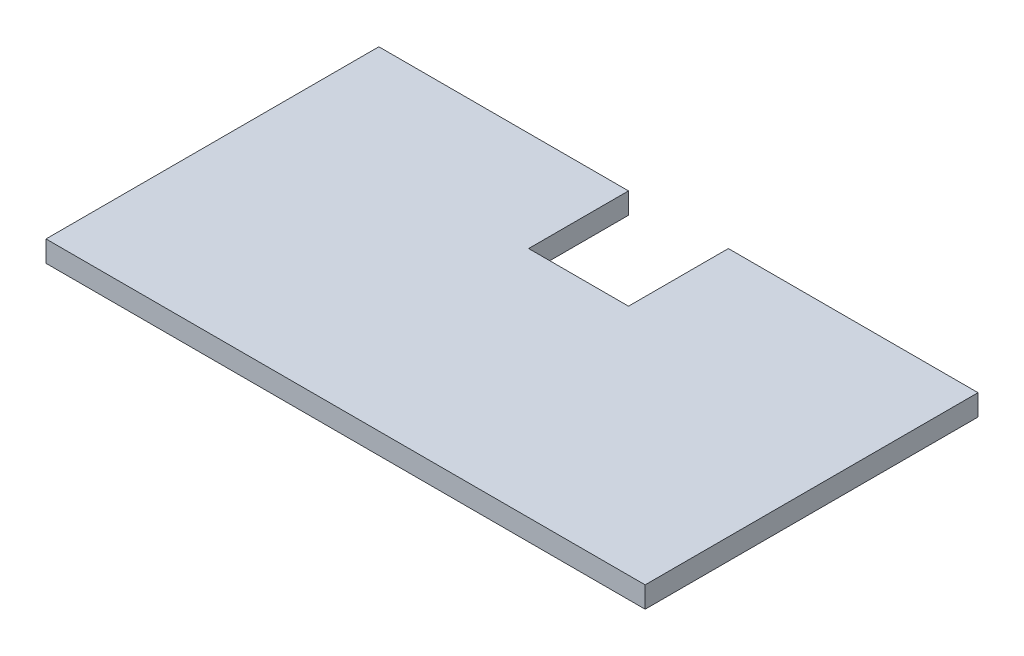
ISO-10303-21;
HEADER;
FILE_DESCRIPTION(('STEP AP214'),'2;1');
FILE_NAME('part.step','',(''),(''),'','','');
FILE_SCHEMA(('AUTOMOTIVE_DESIGN { 1 0 10303 214 1 1 1 1 }'));
ENDSEC;
DATA;
#1=APPLICATION_CONTEXT('core data for automotive mechanical design processes');
#2=APPLICATION_PROTOCOL_DEFINITION('international standard','automotive_design',2000,#1);
#3=PRODUCT_CONTEXT('',#1,'mechanical');
#4=PRODUCT('Part','Part','',(#3));
#5=PRODUCT_RELATED_PRODUCT_CATEGORY('part','',(#4));
#6=PRODUCT_DEFINITION_FORMATION('','',#4);
#7=PRODUCT_DEFINITION_CONTEXT('part definition',#1,'design');
#8=PRODUCT_DEFINITION('design','',#6,#7);
#9=PRODUCT_DEFINITION_SHAPE('','',#8);
#10=(LENGTH_UNIT() NAMED_UNIT(*) SI_UNIT(.MILLI.,.METRE.));
#11=(NAMED_UNIT(*) PLANE_ANGLE_UNIT() SI_UNIT($,.RADIAN.));
#12=(NAMED_UNIT(*) SI_UNIT($,.STERADIAN.) SOLID_ANGLE_UNIT());
#13=UNCERTAINTY_MEASURE_WITH_UNIT(LENGTH_MEASURE(1.E-05),#10,'distance_accuracy_value','');
#14=(GEOMETRIC_REPRESENTATION_CONTEXT(3) GLOBAL_UNCERTAINTY_ASSIGNED_CONTEXT((#13)) GLOBAL_UNIT_ASSIGNED_CONTEXT((#10,
#11,#12)) REPRESENTATION_CONTEXT('',''));
#15=CARTESIAN_POINT('',(0.,0.,0.));
#16=DIRECTION('',(0.,0.,1.));
#17=DIRECTION('',(1.,0.,0.));
#18=AXIS2_PLACEMENT_3D('',#15,#16,#17);
#19=CARTESIAN_POINT('',(-45.,3.175,-25.));
#20=DIRECTION('',(0.,0.,1.));
#21=DIRECTION('',(1.,0.,0.));
#22=AXIS2_PLACEMENT_3D('',#19,#20,#21);
#23=PLANE('',#22);
#24=DIRECTION('',(-1.,0.,0.));
#25=VECTOR('',#24,1.);
#26=CARTESIAN_POINT('',(-45.,3.175,-25.));
#27=LINE('',#26,#25);
#28=CARTESIAN_POINT('',(-7.49999999999999,3.175,-25.));
#29=VERTEX_POINT('',#28);
#30=CARTESIAN_POINT('',(-45.,3.175,-25.));
#31=VERTEX_POINT('',#30);
#32=EDGE_CURVE('E144',#29,#31,#27,.T.);
#33=ORIENTED_EDGE('',*,*,#32,.F.);
#34=DIRECTION('',(0.,1.,0.));
#35=VECTOR('',#34,1.);
#36=CARTESIAN_POINT('',(-7.49999999999999,0.,-25.));
#37=LINE('',#36,#35);
#38=CARTESIAN_POINT('',(-7.49999999999999,0.,-25.));
#39=VERTEX_POINT('',#38);
#40=EDGE_CURVE('E136',#39,#29,#37,.T.);
#41=ORIENTED_EDGE('',*,*,#40,.F.);
#42=DIRECTION('',(-1.,0.,0.));
#43=VECTOR('',#42,1.);
#44=CARTESIAN_POINT('',(-45.,0.,-25.));
#45=LINE('',#44,#43);
#46=CARTESIAN_POINT('',(-45.,0.,-25.));
#47=VERTEX_POINT('',#46);
#48=EDGE_CURVE('E127',#39,#47,#45,.T.);
#49=ORIENTED_EDGE('',*,*,#48,.T.);
#50=DIRECTION('',(0.,-1.,0.));
#51=VECTOR('',#50,1.);
#52=CARTESIAN_POINT('',(-45.,3.175,-25.));
#53=LINE('',#52,#51);
#54=EDGE_CURVE('E40',#31,#47,#53,.T.);
#55=ORIENTED_EDGE('',*,*,#54,.F.);
#56=EDGE_LOOP('',(#33,#41,#49,#55));
#57=FACE_BOUND('',#56,.T.);
#58=ADVANCED_FACE('F32',(#57),#23,.F.);
#59=CARTESIAN_POINT('',(45.,3.175,-25.));
#60=DIRECTION('',(-1.,0.,0.));
#61=DIRECTION('',(0.,0.,1.));
#62=AXIS2_PLACEMENT_3D('',#59,#60,#61);
#63=PLANE('',#62);
#64=DIRECTION('',(0.,0.,-1.));
#65=VECTOR('',#64,1.);
#66=CARTESIAN_POINT('',(45.,0.,-25.));
#67=LINE('',#66,#65);
#68=CARTESIAN_POINT('',(45.,0.,25.));
#69=VERTEX_POINT('',#68);
#70=CARTESIAN_POINT('',(45.,0.,-25.));
#71=VERTEX_POINT('',#70);
#72=EDGE_CURVE('E138',#69,#71,#67,.T.);
#73=ORIENTED_EDGE('',*,*,#72,.T.);
#74=DIRECTION('',(0.,-1.,0.));
#75=VECTOR('',#74,1.);
#76=CARTESIAN_POINT('',(45.,3.175,-25.));
#77=LINE('',#76,#75);
#78=CARTESIAN_POINT('',(45.,3.175,-25.));
#79=VERTEX_POINT('',#78);
#80=EDGE_CURVE('E11',#79,#71,#77,.T.);
#81=ORIENTED_EDGE('',*,*,#80,.F.);
#82=DIRECTION('',(0.,0.,-1.));
#83=VECTOR('',#82,1.);
#84=CARTESIAN_POINT('',(45.,3.175,-25.));
#85=LINE('',#84,#83);
#86=CARTESIAN_POINT('',(45.,3.175,25.));
#87=VERTEX_POINT('',#86);
#88=EDGE_CURVE('E142',#87,#79,#85,.T.);
#89=ORIENTED_EDGE('',*,*,#88,.F.);
#90=DIRECTION('',(0.,-1.,0.));
#91=VECTOR('',#90,1.);
#92=CARTESIAN_POINT('',(45.,3.175,25.));
#93=LINE('',#92,#91);
#94=EDGE_CURVE('E149',#87,#69,#93,.T.);
#95=ORIENTED_EDGE('',*,*,#94,.T.);
#96=EDGE_LOOP('',(#73,#81,#89,#95));
#97=FACE_BOUND('',#96,.T.);
#98=ADVANCED_FACE('F34',(#97),#63,.F.);
#99=CARTESIAN_POINT('',(7.5,0.,-25.));
#100=VERTEX_POINT('',#99);
#101=EDGE_CURVE('E152',#71,#100,#45,.T.);
#102=ORIENTED_EDGE('',*,*,#101,.T.);
#103=DIRECTION('',(0.,1.,0.));
#104=VECTOR('',#103,1.);
#105=CARTESIAN_POINT('',(7.5,0.,-25.));
#106=LINE('',#105,#104);
#107=CARTESIAN_POINT('',(7.5,3.175,-25.));
#108=VERTEX_POINT('',#107);
#109=EDGE_CURVE('E139',#100,#108,#106,.T.);
#110=ORIENTED_EDGE('',*,*,#109,.T.);
#111=EDGE_CURVE('E84',#79,#108,#27,.T.);
#112=ORIENTED_EDGE('',*,*,#111,.F.);
#113=ORIENTED_EDGE('',*,*,#80,.T.);
#114=EDGE_LOOP('',(#102,#110,#112,#113));
#115=FACE_BOUND('',#114,.T.);
#116=ADVANCED_FACE('F181',(#115),#23,.F.);
#117=CARTESIAN_POINT('',(-45.,3.175,-25.));
#118=DIRECTION('',(1.,0.,0.));
#119=DIRECTION('',(0.,0.,-1.));
#120=AXIS2_PLACEMENT_3D('',#117,#118,#119);
#121=PLANE('',#120);
#122=DIRECTION('',(0.,0.,1.));
#123=VECTOR('',#122,1.);
#124=CARTESIAN_POINT('',(-45.,0.,-25.));
#125=LINE('',#124,#123);
#126=CARTESIAN_POINT('',(-45.,0.,25.));
#127=VERTEX_POINT('',#126);
#128=EDGE_CURVE('E155',#47,#127,#125,.T.);
#129=ORIENTED_EDGE('',*,*,#128,.T.);
#130=DIRECTION('',(0.,-1.,0.));
#131=VECTOR('',#130,1.);
#132=CARTESIAN_POINT('',(-45.,3.175,25.));
#133=LINE('',#132,#131);
#134=CARTESIAN_POINT('',(-45.,3.175,25.));
#135=VERTEX_POINT('',#134);
#136=EDGE_CURVE('E159',#135,#127,#133,.T.);
#137=ORIENTED_EDGE('',*,*,#136,.F.);
#138=DIRECTION('',(0.,0.,1.));
#139=VECTOR('',#138,1.);
#140=CARTESIAN_POINT('',(-45.,3.175,-25.));
#141=LINE('',#140,#139);
#142=EDGE_CURVE('E146',#31,#135,#141,.T.);
#143=ORIENTED_EDGE('',*,*,#142,.F.);
#144=ORIENTED_EDGE('',*,*,#54,.T.);
#145=EDGE_LOOP('',(#129,#137,#143,#144));
#146=FACE_BOUND('',#145,.T.);
#147=ADVANCED_FACE('F164',(#146),#121,.F.);
#148=CARTESIAN_POINT('',(-45.,3.175,25.));
#149=DIRECTION('',(0.,0.,-1.));
#150=DIRECTION('',(-1.,0.,0.));
#151=AXIS2_PLACEMENT_3D('',#148,#149,#150);
#152=PLANE('',#151);
#153=DIRECTION('',(1.,0.,0.));
#154=VECTOR('',#153,1.);
#155=CARTESIAN_POINT('',(-45.,0.,25.));
#156=LINE('',#155,#154);
#157=EDGE_CURVE('E77',#127,#69,#156,.T.);
#158=ORIENTED_EDGE('',*,*,#157,.T.);
#159=ORIENTED_EDGE('',*,*,#94,.F.);
#160=DIRECTION('',(1.,0.,0.));
#161=VECTOR('',#160,1.);
#162=CARTESIAN_POINT('',(-45.,3.175,25.));
#163=LINE('',#162,#161);
#164=EDGE_CURVE('E56',#135,#87,#163,.T.);
#165=ORIENTED_EDGE('',*,*,#164,.F.);
#166=ORIENTED_EDGE('',*,*,#136,.T.);
#167=EDGE_LOOP('',(#158,#159,#165,#166));
#168=FACE_BOUND('',#167,.T.);
#169=ADVANCED_FACE('F172',(#168),#152,.F.);
#170=CARTESIAN_POINT('',(0.,3.175,0.));
#171=DIRECTION('',(0.,1.,0.));
#172=DIRECTION('',(0.,0.,1.));
#173=AXIS2_PLACEMENT_3D('',#170,#171,#172);
#174=PLANE('',#173);
#175=DIRECTION('',(0.,0.,1.));
#176=VECTOR('',#175,1.);
#177=CARTESIAN_POINT('',(-7.49999999999999,3.175,-25.));
#178=LINE('',#177,#176);
#179=CARTESIAN_POINT('',(-7.5,3.175,-10.));
#180=VERTEX_POINT('',#179);
#181=EDGE_CURVE('E113',#29,#180,#178,.T.);
#182=ORIENTED_EDGE('',*,*,#181,.F.);
#183=ORIENTED_EDGE('',*,*,#32,.T.);
#184=ORIENTED_EDGE('',*,*,#142,.T.);
#185=ORIENTED_EDGE('',*,*,#164,.T.);
#186=ORIENTED_EDGE('',*,*,#88,.T.);
#187=ORIENTED_EDGE('',*,*,#111,.T.);
#188=DIRECTION('',(0.,0.,-1.));
#189=VECTOR('',#188,1.);
#190=CARTESIAN_POINT('',(7.5,3.175,-25.));
#191=LINE('',#190,#189);
#192=CARTESIAN_POINT('',(7.5,3.175,-10.));
#193=VERTEX_POINT('',#192);
#194=EDGE_CURVE('E128',#193,#108,#191,.T.);
#195=ORIENTED_EDGE('',*,*,#194,.F.);
#196=DIRECTION('',(1.,0.,0.));
#197=VECTOR('',#196,1.);
#198=CARTESIAN_POINT('',(-7.5,3.175,-10.));
#199=LINE('',#198,#197);
#200=EDGE_CURVE('E130',#180,#193,#199,.T.);
#201=ORIENTED_EDGE('',*,*,#200,.F.);
#202=EDGE_LOOP('',(#182,#183,#184,#185,#186,#187,#195,#201));
#203=FACE_BOUND('',#202,.T.);
#204=ADVANCED_FACE('F174',(#203),#174,.T.);
#205=CARTESIAN_POINT('',(0.,0.,0.));
#206=DIRECTION('',(0.,1.,0.));
#207=DIRECTION('',(0.,0.,1.));
#208=AXIS2_PLACEMENT_3D('',#205,#206,#207);
#209=PLANE('',#208);
#210=ORIENTED_EDGE('',*,*,#48,.F.);
#211=DIRECTION('',(0.,0.,1.));
#212=VECTOR('',#211,1.);
#213=CARTESIAN_POINT('',(-7.49999999999999,0.,-25.));
#214=LINE('',#213,#212);
#215=CARTESIAN_POINT('',(-7.5,0.,-10.));
#216=VERTEX_POINT('',#215);
#217=EDGE_CURVE('E110',#39,#216,#214,.T.);
#218=ORIENTED_EDGE('',*,*,#217,.T.);
#219=DIRECTION('',(1.,0.,0.));
#220=VECTOR('',#219,1.);
#221=CARTESIAN_POINT('',(-7.5,0.,-10.));
#222=LINE('',#221,#220);
#223=CARTESIAN_POINT('',(7.5,0.,-10.));
#224=VERTEX_POINT('',#223);
#225=EDGE_CURVE('E120',#216,#224,#222,.T.);
#226=ORIENTED_EDGE('',*,*,#225,.T.);
#227=DIRECTION('',(0.,0.,-1.));
#228=VECTOR('',#227,1.);
#229=CARTESIAN_POINT('',(7.5,0.,-25.));
#230=LINE('',#229,#228);
#231=EDGE_CURVE('E47',#224,#100,#230,.T.);
#232=ORIENTED_EDGE('',*,*,#231,.T.);
#233=ORIENTED_EDGE('',*,*,#101,.F.);
#234=ORIENTED_EDGE('',*,*,#72,.F.);
#235=ORIENTED_EDGE('',*,*,#157,.F.);
#236=ORIENTED_EDGE('',*,*,#128,.F.);
#237=EDGE_LOOP('',(#210,#218,#226,#232,#233,#234,#235,#236));
#238=FACE_BOUND('',#237,.T.);
#239=ADVANCED_FACE('F125',(#238),#209,.F.);
#240=CARTESIAN_POINT('',(-7.49999999999999,0.,-25.));
#241=DIRECTION('',(-1.,0.,0.));
#242=DIRECTION('',(0.,0.,1.));
#243=AXIS2_PLACEMENT_3D('',#240,#241,#242);
#244=PLANE('',#243);
#245=ORIENTED_EDGE('',*,*,#181,.T.);
#246=DIRECTION('',(0.,1.,0.));
#247=VECTOR('',#246,1.);
#248=CARTESIAN_POINT('',(-7.5,0.,-10.));
#249=LINE('',#248,#247);
#250=EDGE_CURVE('E106',#216,#180,#249,.T.);
#251=ORIENTED_EDGE('',*,*,#250,.F.);
#252=ORIENTED_EDGE('',*,*,#217,.F.);
#253=ORIENTED_EDGE('',*,*,#40,.T.);
#254=EDGE_LOOP('',(#245,#251,#252,#253));
#255=FACE_BOUND('',#254,.T.);
#256=ADVANCED_FACE('F108',(#255),#244,.F.);
#257=CARTESIAN_POINT('',(7.5,0.,-25.));
#258=DIRECTION('',(1.,0.,0.));
#259=DIRECTION('',(0.,0.,-1.));
#260=AXIS2_PLACEMENT_3D('',#257,#258,#259);
#261=PLANE('',#260);
#262=ORIENTED_EDGE('',*,*,#194,.T.);
#263=ORIENTED_EDGE('',*,*,#109,.F.);
#264=ORIENTED_EDGE('',*,*,#231,.F.);
#265=DIRECTION('',(0.,1.,0.));
#266=VECTOR('',#265,1.);
#267=CARTESIAN_POINT('',(7.5,0.,-10.));
#268=LINE('',#267,#266);
#269=EDGE_CURVE('E117',#224,#193,#268,.T.);
#270=ORIENTED_EDGE('',*,*,#269,.T.);
#271=EDGE_LOOP('',(#262,#263,#264,#270));
#272=FACE_BOUND('',#271,.T.);
#273=ADVANCED_FACE('F192',(#272),#261,.F.);
#274=CARTESIAN_POINT('',(-7.5,0.,-10.));
#275=DIRECTION('',(0.,0.,1.));
#276=DIRECTION('',(1.,0.,0.));
#277=AXIS2_PLACEMENT_3D('',#274,#275,#276);
#278=PLANE('',#277);
#279=ORIENTED_EDGE('',*,*,#200,.T.);
#280=ORIENTED_EDGE('',*,*,#269,.F.);
#281=ORIENTED_EDGE('',*,*,#225,.F.);
#282=ORIENTED_EDGE('',*,*,#250,.T.);
#283=EDGE_LOOP('',(#279,#280,#281,#282));
#284=FACE_BOUND('',#283,.T.);
#285=ADVANCED_FACE('F121',(#284),#278,.F.);
#286=CLOSED_SHELL('',(#58,#98,#116,#147,#169,#204,#239,#256,#273,#285));
#287=MANIFOLD_SOLID_BREP('B2',#286);
#288=ADVANCED_BREP_SHAPE_REPRESENTATION('',(#18,#287),#14);
#289=SHAPE_DEFINITION_REPRESENTATION(#9,#288);
ENDSEC;
END-ISO-10303-21;
